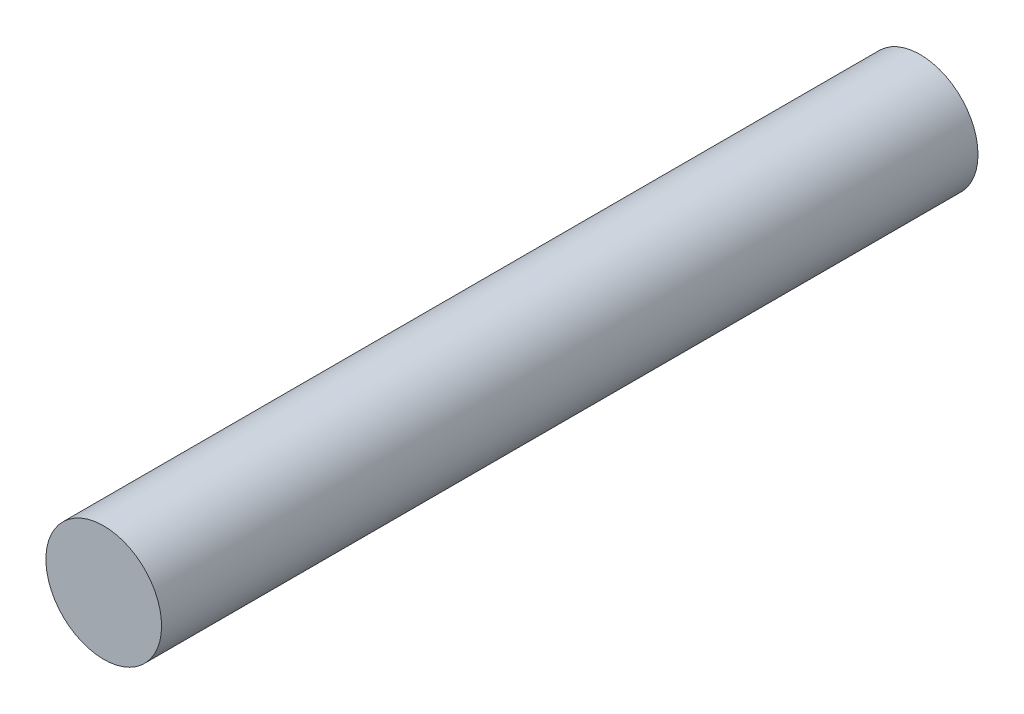
ISO-10303-21;
HEADER;
FILE_DESCRIPTION(('STEP AP214'),'2;1');
FILE_NAME('part.step','',(''),(''),'','','');
FILE_SCHEMA(('AUTOMOTIVE_DESIGN { 1 0 10303 214 1 1 1 1 }'));
ENDSEC;
DATA;
#1=APPLICATION_CONTEXT('core data for automotive mechanical design processes');
#2=APPLICATION_PROTOCOL_DEFINITION('international standard','automotive_design',2000,#1);
#3=PRODUCT_CONTEXT('',#1,'mechanical');
#4=PRODUCT('Part','Part','',(#3));
#5=PRODUCT_RELATED_PRODUCT_CATEGORY('part','',(#4));
#6=PRODUCT_DEFINITION_FORMATION('','',#4);
#7=PRODUCT_DEFINITION_CONTEXT('part definition',#1,'design');
#8=PRODUCT_DEFINITION('design','',#6,#7);
#9=PRODUCT_DEFINITION_SHAPE('','',#8);
#10=(LENGTH_UNIT() NAMED_UNIT(*) SI_UNIT(.MILLI.,.METRE.));
#11=(NAMED_UNIT(*) PLANE_ANGLE_UNIT() SI_UNIT($,.RADIAN.));
#12=(NAMED_UNIT(*) SI_UNIT($,.STERADIAN.) SOLID_ANGLE_UNIT());
#13=UNCERTAINTY_MEASURE_WITH_UNIT(LENGTH_MEASURE(1.E-05),#10,'distance_accuracy_value','');
#14=(GEOMETRIC_REPRESENTATION_CONTEXT(3) GLOBAL_UNCERTAINTY_ASSIGNED_CONTEXT((#13)) GLOBAL_UNIT_ASSIGNED_CONTEXT((#10,
#11,#12)) REPRESENTATION_CONTEXT('',''));
#15=CARTESIAN_POINT('',(0.,0.,0.));
#16=DIRECTION('',(0.,0.,1.));
#17=DIRECTION('',(1.,0.,0.));
#18=AXIS2_PLACEMENT_3D('',#15,#16,#17);
#19=CARTESIAN_POINT('',(0.,0.,60.));
#20=DIRECTION('',(0.,0.,-1.));
#21=DIRECTION('',(-1.,0.,0.));
#22=AXIS2_PLACEMENT_3D('',#19,#20,#21);
#23=CYLINDRICAL_SURFACE('',#22,8.5);
#24=CARTESIAN_POINT('',(0.,0.,60.));
#25=DIRECTION('',(0.,0.,1.));
#26=DIRECTION('',(1.,0.,0.));
#27=AXIS2_PLACEMENT_3D('',#24,#25,#26);
#28=CIRCLE('',#27,8.5);
#29=CARTESIAN_POINT('',(8.5,0.,60.));
#30=VERTEX_POINT('',#29);
#31=EDGE_CURVE('E10',#30,#30,#28,.T.);
#32=ORIENTED_EDGE('',*,*,#31,.F.);
#33=EDGE_LOOP('',(#32));
#34=FACE_BOUND('',#33,.T.);
#35=CARTESIAN_POINT('',(0.,0.,-60.));
#36=DIRECTION('',(0.,0.,1.));
#37=DIRECTION('',(1.,0.,0.));
#38=AXIS2_PLACEMENT_3D('',#35,#36,#37);
#39=CIRCLE('',#38,8.5);
#40=CARTESIAN_POINT('',(8.5,0.,-60.));
#41=VERTEX_POINT('',#40);
#42=EDGE_CURVE('E40',#41,#41,#39,.T.);
#43=ORIENTED_EDGE('',*,*,#42,.T.);
#44=EDGE_LOOP('',(#43));
#45=FACE_BOUND('',#44,.T.);
#46=ADVANCED_FACE('F37',(#34,#45),#23,.T.);
#47=CARTESIAN_POINT('',(0.,0.,60.));
#48=DIRECTION('',(0.,0.,1.));
#49=DIRECTION('',(1.,0.,0.));
#50=AXIS2_PLACEMENT_3D('',#47,#48,#49);
#51=PLANE('',#50);
#52=ORIENTED_EDGE('',*,*,#31,.T.);
#53=EDGE_LOOP('',(#52));
#54=FACE_BOUND('',#53,.T.);
#55=ADVANCED_FACE('F52',(#54),#51,.T.);
#56=CARTESIAN_POINT('',(0.,0.,-60.));
#57=DIRECTION('',(0.,0.,1.));
#58=DIRECTION('',(1.,0.,0.));
#59=AXIS2_PLACEMENT_3D('',#56,#57,#58);
#60=PLANE('',#59);
#61=ORIENTED_EDGE('',*,*,#42,.F.);
#62=EDGE_LOOP('',(#61));
#63=FACE_BOUND('',#62,.T.);
#64=ADVANCED_FACE('F50',(#63),#60,.F.);
#65=CLOSED_SHELL('',(#46,#55,#64));
#66=MANIFOLD_SOLID_BREP('B2',#65);
#67=ADVANCED_BREP_SHAPE_REPRESENTATION('',(#18,#66),#14);
#68=SHAPE_DEFINITION_REPRESENTATION(#9,#67);
ENDSEC;
END-ISO-10303-21;
